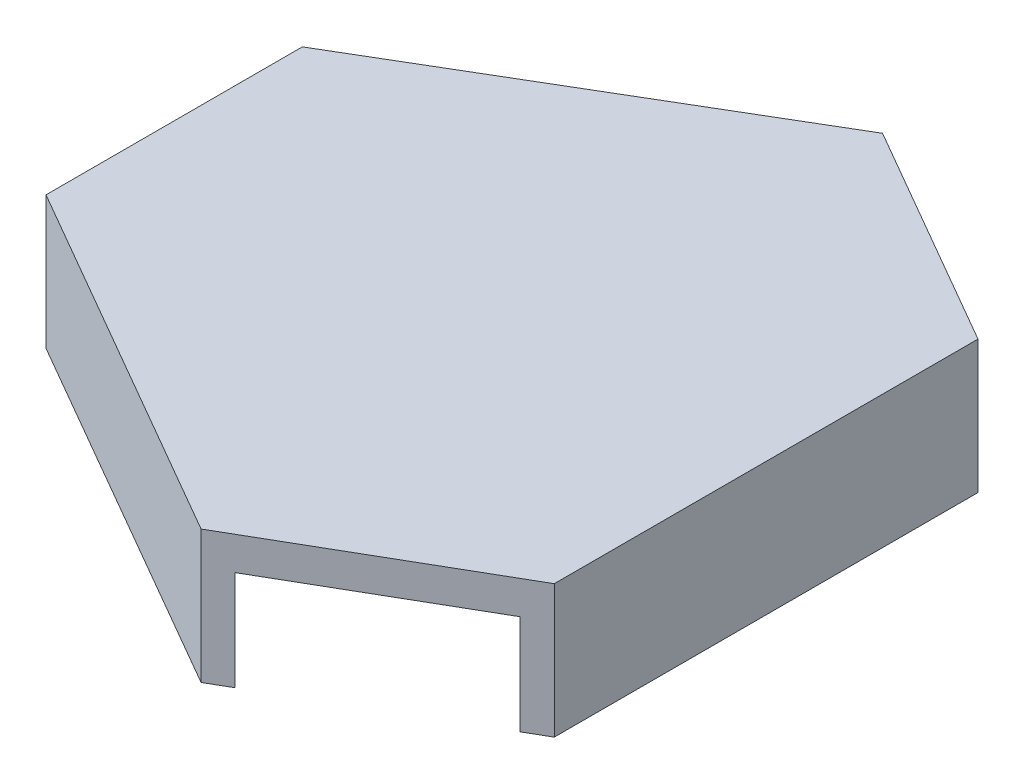
ISO-10303-21;
HEADER;
FILE_DESCRIPTION(('STEP AP214'),'2;1');
FILE_NAME('part.step','',(''),(''),'','','');
FILE_SCHEMA(('AUTOMOTIVE_DESIGN { 1 0 10303 214 1 1 1 1 }'));
ENDSEC;
DATA;
#1=APPLICATION_CONTEXT('core data for automotive mechanical design processes');
#2=APPLICATION_PROTOCOL_DEFINITION('international standard','automotive_design',2000,#1);
#3=PRODUCT_CONTEXT('',#1,'mechanical');
#4=PRODUCT('Part','Part','',(#3));
#5=PRODUCT_RELATED_PRODUCT_CATEGORY('part','',(#4));
#6=PRODUCT_DEFINITION_FORMATION('','',#4);
#7=PRODUCT_DEFINITION_CONTEXT('part definition',#1,'design');
#8=PRODUCT_DEFINITION('design','',#6,#7);
#9=PRODUCT_DEFINITION_SHAPE('','',#8);
#10=(LENGTH_UNIT() NAMED_UNIT(*) SI_UNIT(.MILLI.,.METRE.));
#11=(NAMED_UNIT(*) PLANE_ANGLE_UNIT() SI_UNIT($,.RADIAN.));
#12=(NAMED_UNIT(*) SI_UNIT($,.STERADIAN.) SOLID_ANGLE_UNIT());
#13=UNCERTAINTY_MEASURE_WITH_UNIT(LENGTH_MEASURE(1.E-05),#10,'distance_accuracy_value','');
#14=(GEOMETRIC_REPRESENTATION_CONTEXT(3) GLOBAL_UNCERTAINTY_ASSIGNED_CONTEXT((#13)) GLOBAL_UNIT_ASSIGNED_CONTEXT((#10,
#11,#12)) REPRESENTATION_CONTEXT('',''));
#15=CARTESIAN_POINT('',(0.,0.,0.));
#16=DIRECTION('',(0.,0.,1.));
#17=DIRECTION('',(1.,0.,0.));
#18=AXIS2_PLACEMENT_3D('',#15,#16,#17);
#19=CARTESIAN_POINT('',(0.,0.,0.));
#20=DIRECTION('',(0.,-1.,0.));
#21=DIRECTION('',(0.,0.,-1.));
#22=AXIS2_PLACEMENT_3D('',#19,#20,#21);
#23=PLANE('',#22);
#24=DIRECTION('',(-0.865982000114035,0.,-0.500075169827992));
#25=VECTOR('',#24,1.);
#26=CARTESIAN_POINT('',(1.84177889865107,0.,-10.3000063857236));
#27=LINE('',#26,#25);
#28=CARTESIAN_POINT('',(7.99206405038261,0.,-6.74842576241073));
#29=VERTEX_POINT('',#28);
#30=CARTESIAN_POINT('',(2.48777328000961,0.,-9.92696658821826));
#31=VERTEX_POINT('',#30);
#32=EDGE_CURVE('E190',#29,#31,#27,.T.);
#33=ORIENTED_EDGE('',*,*,#32,.F.);
#34=DIRECTION('',(8.68008158397888E-05,0.,-0.999999996232809));
#35=VECTOR('',#34,1.);
#36=CARTESIAN_POINT('',(7.99206405038261,0.,-6.74842576241073));
#37=LINE('',#36,#35);
#38=CARTESIAN_POINT('',(7.99089223936877,0.,6.75157418673219));
#39=VERTEX_POINT('',#38);
#40=EDGE_CURVE('E140',#39,#29,#37,.T.);
#41=ORIENTED_EDGE('',*,*,#40,.F.);
#42=DIRECTION('',(0.866082849184076,0.,-0.499900488446644));
#43=VECTOR('',#42,1.);
#44=CARTESIAN_POINT('',(8.6404649154148,0.,6.37664273722604));
#45=LINE('',#44,#43);
#46=CARTESIAN_POINT('',(2.55121736664581,0.,9.89133861969257));
#47=VERTEX_POINT('',#46);
#48=EDGE_CURVE('E145',#47,#39,#45,.T.);
#49=ORIENTED_EDGE('',*,*,#48,.F.);
#50=DIRECTION('',(0.866025403784439,0.,0.5));
#51=VECTOR('',#50,1.);
#52=CARTESIAN_POINT('',(2.55121736664581,0.,9.89133861969257));
#53=LINE('',#52,#51);
#54=CARTESIAN_POINT('',(-9.14012558444411,0.,3.14133861969256));
#55=VERTEX_POINT('',#54);
#56=EDGE_CURVE('E166',#55,#47,#53,.T.);
#57=ORIENTED_EDGE('',*,*,#56,.F.);
#58=DIRECTION('',(0.,0.,1.));
#59=VECTOR('',#58,1.);
#60=CARTESIAN_POINT('',(-9.14012558444411,0.,-3.82233134569774));
#61=LINE('',#60,#59);
#62=CARTESIAN_POINT('',(-9.14012558444411,0.,-3.0682518399556));
#63=VERTEX_POINT('',#62);
#64=EDGE_CURVE('E185',#63,#55,#61,.T.);
#65=ORIENTED_EDGE('',*,*,#64,.F.);
#66=DIRECTION('',(-0.861325841811387,0.,0.508052944315753));
#67=VECTOR('',#66,1.);
#68=CARTESIAN_POINT('',(-9.14012558444411,0.,-3.0682518399556));
#69=LINE('',#68,#67);
#70=EDGE_CURVE('E146',#31,#63,#69,.T.);
#71=ORIENTED_EDGE('',*,*,#70,.F.);
#72=EDGE_LOOP('',(#33,#41,#49,#57,#65,#71));
#73=FACE_BOUND('',#72,.T.);
#74=ADVANCED_FACE('F34',(#73),#23,.T.);
#75=CARTESIAN_POINT('',(-9.14012558444411,1.,-3.82233134569774));
#76=DIRECTION('',(1.,0.,0.));
#77=DIRECTION('',(0.,0.,-1.));
#78=AXIS2_PLACEMENT_3D('',#75,#76,#77);
#79=PLANE('',#78);
#80=DIRECTION('',(0.,-1.,0.));
#81=VECTOR('',#80,1.);
#82=CARTESIAN_POINT('',(-9.14012558444411,1.,-3.82233134569774));
#83=LINE('',#82,#81);
#84=CARTESIAN_POINT('',(-9.14012558444411,1.,-3.82233134569774));
#85=VERTEX_POINT('',#84);
#86=CARTESIAN_POINT('',(-9.14012558444411,-3.,-3.82233134569774));
#87=VERTEX_POINT('',#86);
#88=EDGE_CURVE('E200',#85,#87,#83,.T.);
#89=ORIENTED_EDGE('',*,*,#88,.T.);
#90=DIRECTION('',(0.,0.,-1.));
#91=VECTOR('',#90,1.);
#92=CARTESIAN_POINT('',(-9.14012558444411,-3.,-3.82233134569774));
#93=LINE('',#92,#91);
#94=CARTESIAN_POINT('',(-9.14012558444411,-3.,-3.0682518399556));
#95=VERTEX_POINT('',#94);
#96=EDGE_CURVE('E159',#95,#87,#93,.T.);
#97=ORIENTED_EDGE('',*,*,#96,.F.);
#98=DIRECTION('',(0.,1.,0.));
#99=VECTOR('',#98,1.);
#100=CARTESIAN_POINT('',(-9.14012558444411,-3.,-3.0682518399556));
#101=LINE('',#100,#99);
#102=EDGE_CURVE('E57',#95,#63,#101,.T.);
#103=ORIENTED_EDGE('',*,*,#102,.T.);
#104=ORIENTED_EDGE('',*,*,#64,.T.);
#105=DIRECTION('',(0.,1.,0.));
#106=VECTOR('',#105,1.);
#107=CARTESIAN_POINT('',(-9.14012558444411,-3.,3.14133861969256));
#108=LINE('',#107,#106);
#109=CARTESIAN_POINT('',(-9.14012558444411,-3.,3.14133861969256));
#110=VERTEX_POINT('',#109);
#111=EDGE_CURVE('E182',#110,#55,#108,.T.);
#112=ORIENTED_EDGE('',*,*,#111,.F.);
#113=DIRECTION('',(0.,0.,-1.));
#114=VECTOR('',#113,1.);
#115=CARTESIAN_POINT('',(-9.14012558444411,-3.,3.14133861969256));
#116=LINE('',#115,#114);
#117=CARTESIAN_POINT('',(-9.14012558444411,-3.,3.89123911804001));
#118=VERTEX_POINT('',#117);
#119=EDGE_CURVE('E167',#118,#110,#116,.T.);
#120=ORIENTED_EDGE('',*,*,#119,.F.);
#121=DIRECTION('',(0.,-1.,0.));
#122=VECTOR('',#121,1.);
#123=CARTESIAN_POINT('',(-9.14012558444411,1.,3.89123911804001));
#124=LINE('',#123,#122);
#125=CARTESIAN_POINT('',(-9.14012558444411,1.,3.89123911804001));
#126=VERTEX_POINT('',#125);
#127=EDGE_CURVE('E11',#126,#118,#124,.T.);
#128=ORIENTED_EDGE('',*,*,#127,.F.);
#129=DIRECTION('',(0.,0.,1.));
#130=VECTOR('',#129,1.);
#131=CARTESIAN_POINT('',(-9.14012558444411,1.,-3.82233134569774));
#132=LINE('',#131,#130);
#133=EDGE_CURVE('E186',#85,#126,#132,.T.);
#134=ORIENTED_EDGE('',*,*,#133,.F.);
#135=EDGE_LOOP('',(#89,#97,#103,#104,#112,#120,#128,#134));
#136=FACE_BOUND('',#135,.T.);
#137=ADVANCED_FACE('F36',(#136),#79,.F.);
#138=CARTESIAN_POINT('',(-9.14012558444411,1.,3.89123911804001));
#139=DIRECTION('',(0.5,0.,-0.866025403784439));
#140=DIRECTION('',(-0.866025403784439,0.,-0.5));
#141=AXIS2_PLACEMENT_3D('',#138,#139,#140);
#142=PLANE('',#141);
#143=ORIENTED_EDGE('',*,*,#127,.T.);
#144=DIRECTION('',(-0.866025403784439,0.,-0.5));
#145=VECTOR('',#144,1.);
#146=CARTESIAN_POINT('',(-9.14012558444411,-3.,3.89123911804001));
#147=LINE('',#146,#145);
#148=CARTESIAN_POINT('',(1.90169831380748,-3.,10.26623911804));
#149=VERTEX_POINT('',#148);
#150=EDGE_CURVE('E175',#149,#118,#147,.T.);
#151=ORIENTED_EDGE('',*,*,#150,.F.);
#152=DIRECTION('',(0.,-1.,0.));
#153=VECTOR('',#152,1.);
#154=CARTESIAN_POINT('',(1.90169831380748,1.,10.26623911804));
#155=LINE('',#154,#153);
#156=CARTESIAN_POINT('',(1.90169831380748,1.,10.26623911804));
#157=VERTEX_POINT('',#156);
#158=EDGE_CURVE('E42',#157,#149,#155,.T.);
#159=ORIENTED_EDGE('',*,*,#158,.F.);
#160=DIRECTION('',(0.866025403784439,0.,0.5));
#161=VECTOR('',#160,1.);
#162=CARTESIAN_POINT('',(-9.14012558444411,1.,3.89123911804001));
#163=LINE('',#162,#161);
#164=EDGE_CURVE('E189',#126,#157,#163,.T.);
#165=ORIENTED_EDGE('',*,*,#164,.F.);
#166=EDGE_LOOP('',(#143,#151,#159,#165));
#167=FACE_BOUND('',#166,.T.);
#168=ADVANCED_FACE('F219',(#167),#142,.F.);
#169=CARTESIAN_POINT('',(8.6404649154148,1.,6.37664273722604));
#170=DIRECTION('',(-0.499900488446644,0.,-0.866082849184076));
#171=DIRECTION('',(-0.866082849184076,0.,0.499900488446644));
#172=AXIS2_PLACEMENT_3D('',#169,#170,#171);
#173=PLANE('',#172);
#174=ORIENTED_EDGE('',*,*,#158,.T.);
#175=DIRECTION('',(-0.866082849184076,0.,0.499900488446644));
#176=VECTOR('',#175,1.);
#177=CARTESIAN_POINT('',(1.90169831380748,-3.,10.26623911804));
#178=LINE('',#177,#176);
#179=CARTESIAN_POINT('',(2.55121736664581,-3.,9.89133861969257));
#180=VERTEX_POINT('',#179);
#181=EDGE_CURVE('E172',#180,#149,#178,.T.);
#182=ORIENTED_EDGE('',*,*,#181,.F.);
#183=DIRECTION('',(0.,1.,0.));
#184=VECTOR('',#183,1.);
#185=CARTESIAN_POINT('',(2.55121736664581,-3.,9.89133861969257));
#186=LINE('',#185,#184);
#187=EDGE_CURVE('E178',#180,#47,#186,.T.);
#188=ORIENTED_EDGE('',*,*,#187,.T.);
#189=ORIENTED_EDGE('',*,*,#48,.T.);
#190=DIRECTION('',(0.,1.,0.));
#191=VECTOR('',#190,1.);
#192=CARTESIAN_POINT('',(7.99089223936877,-3.,6.75157418673219));
#193=LINE('',#192,#191);
#194=CARTESIAN_POINT('',(7.99089223936877,-3.,6.75157418673219));
#195=VERTEX_POINT('',#194);
#196=EDGE_CURVE('E126',#195,#39,#193,.T.);
#197=ORIENTED_EDGE('',*,*,#196,.F.);
#198=DIRECTION('',(-0.866082849184076,0.,0.499900488446644));
#199=VECTOR('',#198,1.);
#200=CARTESIAN_POINT('',(7.99089223936877,-3.,6.75157418673219));
#201=LINE('',#200,#199);
#202=CARTESIAN_POINT('',(8.6404649154148,-3.,6.37664273722604));
#203=VERTEX_POINT('',#202);
#204=EDGE_CURVE('E131',#203,#195,#201,.T.);
#205=ORIENTED_EDGE('',*,*,#204,.F.);
#206=DIRECTION('',(0.,-1.,0.));
#207=VECTOR('',#206,1.);
#208=CARTESIAN_POINT('',(8.6404649154148,1.,6.37664273722604));
#209=LINE('',#208,#207);
#210=CARTESIAN_POINT('',(8.6404649154148,1.,6.37664273722604));
#211=VERTEX_POINT('',#210);
#212=EDGE_CURVE('E209',#211,#203,#209,.T.);
#213=ORIENTED_EDGE('',*,*,#212,.F.);
#214=DIRECTION('',(0.866082849184076,0.,-0.499900488446644));
#215=VECTOR('',#214,1.);
#216=CARTESIAN_POINT('',(8.6404649154148,1.,6.37664273722604));
#217=LINE('',#216,#215);
#218=EDGE_CURVE('E192',#157,#211,#217,.T.);
#219=ORIENTED_EDGE('',*,*,#218,.F.);
#220=EDGE_LOOP('',(#174,#182,#188,#189,#197,#205,#213,#219));
#221=FACE_BOUND('',#220,.T.);
#222=ADVANCED_FACE('F143',(#221),#173,.F.);
#223=CARTESIAN_POINT('',(8.6404649154148,1.,6.37664273722604));
#224=DIRECTION('',(-0.999999996232809,0.,-8.68008158398795E-05));
#225=DIRECTION('',(-8.68008158398795E-05,0.,0.999999996232809));
#226=AXIS2_PLACEMENT_3D('',#223,#224,#225);
#227=PLANE('',#226);
#228=ORIENTED_EDGE('',*,*,#212,.T.);
#229=DIRECTION('',(-8.68008158398795E-05,0.,0.999999996232809));
#230=VECTOR('',#229,1.);
#231=CARTESIAN_POINT('',(8.6404649154148,-3.,6.37664273722604));
#232=LINE('',#231,#230);
#233=CARTESIAN_POINT('',(8.64157162581676,-3.,-6.37335721474227));
#234=VERTEX_POINT('',#233);
#235=EDGE_CURVE('E137',#234,#203,#232,.T.);
#236=ORIENTED_EDGE('',*,*,#235,.F.);
#237=DIRECTION('',(0.,-1.,0.));
#238=VECTOR('',#237,1.);
#239=CARTESIAN_POINT('',(8.64157162581676,1.,-6.37335721474227));
#240=LINE('',#239,#238);
#241=CARTESIAN_POINT('',(8.64157162581676,1.,-6.37335721474227));
#242=VERTEX_POINT('',#241);
#243=EDGE_CURVE('E207',#242,#234,#240,.T.);
#244=ORIENTED_EDGE('',*,*,#243,.F.);
#245=DIRECTION('',(8.68008158398795E-05,0.,-0.999999996232809));
#246=VECTOR('',#245,1.);
#247=CARTESIAN_POINT('',(8.6404649154148,1.,6.37664273722604));
#248=LINE('',#247,#246);
#249=EDGE_CURVE('E194',#211,#242,#248,.T.);
#250=ORIENTED_EDGE('',*,*,#249,.F.);
#251=EDGE_LOOP('',(#228,#236,#244,#250));
#252=FACE_BOUND('',#251,.T.);
#253=ADVANCED_FACE('F234',(#252),#227,.F.);
#254=CARTESIAN_POINT('',(1.84177889865107,1.,-10.3000063857236));
#255=DIRECTION('',(-0.500075169827992,0.,0.865982000114035));
#256=DIRECTION('',(0.865982000114035,0.,0.500075169827992));
#257=AXIS2_PLACEMENT_3D('',#254,#255,#256);
#258=PLANE('',#257);
#259=ORIENTED_EDGE('',*,*,#243,.T.);
#260=DIRECTION('',(0.865982000114036,0.,0.500075169827992));
#261=VECTOR('',#260,1.);
#262=CARTESIAN_POINT('',(8.64157162581676,-3.,-6.37335721474227));
#263=LINE('',#262,#261);
#264=CARTESIAN_POINT('',(7.99206405038261,-3.,-6.74842576241073));
#265=VERTEX_POINT('',#264);
#266=EDGE_CURVE('E130',#265,#234,#263,.T.);
#267=ORIENTED_EDGE('',*,*,#266,.F.);
#268=DIRECTION('',(0.,1.,0.));
#269=VECTOR('',#268,1.);
#270=CARTESIAN_POINT('',(7.99206405038261,-3.,-6.74842576241073));
#271=LINE('',#270,#269);
#272=EDGE_CURVE('E49',#265,#29,#271,.T.);
#273=ORIENTED_EDGE('',*,*,#272,.T.);
#274=ORIENTED_EDGE('',*,*,#32,.T.);
#275=DIRECTION('',(0.,1.,0.));
#276=VECTOR('',#275,1.);
#277=CARTESIAN_POINT('',(2.48777328000961,-3.,-9.92696658821826));
#278=LINE('',#277,#276);
#279=CARTESIAN_POINT('',(2.48777328000961,-3.,-9.92696658821826));
#280=VERTEX_POINT('',#279);
#281=EDGE_CURVE('E163',#280,#31,#278,.T.);
#282=ORIENTED_EDGE('',*,*,#281,.F.);
#283=DIRECTION('',(0.865982000114035,0.,0.500075169827993));
#284=VECTOR('',#283,1.);
#285=CARTESIAN_POINT('',(2.48777328000961,-3.,-9.92696658821826));
#286=LINE('',#285,#284);
#287=CARTESIAN_POINT('',(1.84177889865107,-3.,-10.3000063857236));
#288=VERTEX_POINT('',#287);
#289=EDGE_CURVE('E155',#288,#280,#286,.T.);
#290=ORIENTED_EDGE('',*,*,#289,.F.);
#291=DIRECTION('',(0.,-1.,0.));
#292=VECTOR('',#291,1.);
#293=CARTESIAN_POINT('',(1.84177889865107,1.,-10.3000063857236));
#294=LINE('',#293,#292);
#295=CARTESIAN_POINT('',(1.84177889865107,1.,-10.3000063857236));
#296=VERTEX_POINT('',#295);
#297=EDGE_CURVE('E205',#296,#288,#294,.T.);
#298=ORIENTED_EDGE('',*,*,#297,.F.);
#299=DIRECTION('',(-0.865982000114035,0.,-0.500075169827992));
#300=VECTOR('',#299,1.);
#301=CARTESIAN_POINT('',(1.84177889865107,1.,-10.3000063857236));
#302=LINE('',#301,#300);
#303=EDGE_CURVE('E196',#242,#296,#302,.T.);
#304=ORIENTED_EDGE('',*,*,#303,.F.);
#305=EDGE_LOOP('',(#259,#267,#273,#274,#282,#290,#298,#304));
#306=FACE_BOUND('',#305,.T.);
#307=ADVANCED_FACE('F252',(#306),#258,.F.);
#308=CARTESIAN_POINT('',(-9.14012558444411,1.,-3.82233134569774));
#309=DIRECTION('',(0.508052944315753,0.,0.861325841811387));
#310=DIRECTION('',(0.861325841811387,0.,-0.508052944315753));
#311=AXIS2_PLACEMENT_3D('',#308,#309,#310);
#312=PLANE('',#311);
#313=ORIENTED_EDGE('',*,*,#297,.T.);
#314=DIRECTION('',(0.861325841811387,0.,-0.508052944315753));
#315=VECTOR('',#314,1.);
#316=CARTESIAN_POINT('',(1.84177889865107,-3.,-10.3000063857236));
#317=LINE('',#316,#315);
#318=EDGE_CURVE('E148',#87,#288,#317,.T.);
#319=ORIENTED_EDGE('',*,*,#318,.F.);
#320=ORIENTED_EDGE('',*,*,#88,.F.);
#321=DIRECTION('',(-0.861325841811387,0.,0.508052944315753));
#322=VECTOR('',#321,1.);
#323=CARTESIAN_POINT('',(-9.14012558444411,1.,-3.82233134569774));
#324=LINE('',#323,#322);
#325=EDGE_CURVE('E198',#296,#85,#324,.T.);
#326=ORIENTED_EDGE('',*,*,#325,.F.);
#327=EDGE_LOOP('',(#313,#319,#320,#326));
#328=FACE_BOUND('',#327,.T.);
#329=ADVANCED_FACE('F244',(#328),#312,.F.);
#330=CARTESIAN_POINT('',(0.,1.,0.));
#331=DIRECTION('',(0.,-1.,0.));
#332=DIRECTION('',(0.,0.,-1.));
#333=AXIS2_PLACEMENT_3D('',#330,#331,#332);
#334=PLANE('',#333);
#335=ORIENTED_EDGE('',*,*,#133,.T.);
#336=ORIENTED_EDGE('',*,*,#164,.T.);
#337=ORIENTED_EDGE('',*,*,#218,.T.);
#338=ORIENTED_EDGE('',*,*,#249,.T.);
#339=ORIENTED_EDGE('',*,*,#303,.T.);
#340=ORIENTED_EDGE('',*,*,#325,.T.);
#341=EDGE_LOOP('',(#335,#336,#337,#338,#339,#340));
#342=FACE_BOUND('',#341,.T.);
#343=ADVANCED_FACE('F238',(#342),#334,.F.);
#344=CARTESIAN_POINT('',(2.55121736664581,-3.,9.89133861969257));
#345=DIRECTION('',(-0.5,0.,0.866025403784439));
#346=DIRECTION('',(0.866025403784439,0.,0.5));
#347=AXIS2_PLACEMENT_3D('',#344,#345,#346);
#348=PLANE('',#347);
#349=ORIENTED_EDGE('',*,*,#56,.T.);
#350=ORIENTED_EDGE('',*,*,#187,.F.);
#351=DIRECTION('',(0.866025403784439,0.,0.5));
#352=VECTOR('',#351,1.);
#353=CARTESIAN_POINT('',(2.55121736664581,-3.,9.89133861969257));
#354=LINE('',#353,#352);
#355=EDGE_CURVE('E170',#110,#180,#354,.T.);
#356=ORIENTED_EDGE('',*,*,#355,.F.);
#357=ORIENTED_EDGE('',*,*,#111,.T.);
#358=EDGE_LOOP('',(#349,#350,#356,#357));
#359=FACE_BOUND('',#358,.T.);
#360=ADVANCED_FACE('F226',(#359),#348,.F.);
#361=CARTESIAN_POINT('',(0.,-3.,0.));
#362=DIRECTION('',(0.,1.,0.));
#363=DIRECTION('',(0.,0.,1.));
#364=AXIS2_PLACEMENT_3D('',#361,#362,#363);
#365=PLANE('',#364);
#366=ORIENTED_EDGE('',*,*,#119,.T.);
#367=ORIENTED_EDGE('',*,*,#355,.T.);
#368=ORIENTED_EDGE('',*,*,#181,.T.);
#369=ORIENTED_EDGE('',*,*,#150,.T.);
#370=EDGE_LOOP('',(#366,#367,#368,#369));
#371=FACE_BOUND('',#370,.T.);
#372=ADVANCED_FACE('F216',(#371),#365,.F.);
#373=CARTESIAN_POINT('',(-9.14012558444411,-3.,-3.0682518399556));
#374=DIRECTION('',(-0.508052944315753,0.,-0.861325841811387));
#375=DIRECTION('',(-0.861325841811387,0.,0.508052944315753));
#376=AXIS2_PLACEMENT_3D('',#373,#374,#375);
#377=PLANE('',#376);
#378=ORIENTED_EDGE('',*,*,#70,.T.);
#379=ORIENTED_EDGE('',*,*,#102,.F.);
#380=DIRECTION('',(-0.861325841811387,0.,0.508052944315753));
#381=VECTOR('',#380,1.);
#382=CARTESIAN_POINT('',(-9.14012558444411,-3.,-3.0682518399556));
#383=LINE('',#382,#381);
#384=EDGE_CURVE('E157',#280,#95,#383,.T.);
#385=ORIENTED_EDGE('',*,*,#384,.F.);
#386=ORIENTED_EDGE('',*,*,#281,.T.);
#387=EDGE_LOOP('',(#378,#379,#385,#386));
#388=FACE_BOUND('',#387,.T.);
#389=ADVANCED_FACE('F251',(#388),#377,.F.);
#390=CARTESIAN_POINT('',(0.,-3.,0.));
#391=DIRECTION('',(0.,-1.,0.));
#392=DIRECTION('',(0.,0.,-1.));
#393=AXIS2_PLACEMENT_3D('',#390,#391,#392);
#394=PLANE('',#393);
#395=ORIENTED_EDGE('',*,*,#318,.T.);
#396=ORIENTED_EDGE('',*,*,#289,.T.);
#397=ORIENTED_EDGE('',*,*,#384,.T.);
#398=ORIENTED_EDGE('',*,*,#96,.T.);
#399=EDGE_LOOP('',(#395,#396,#397,#398));
#400=FACE_BOUND('',#399,.T.);
#401=ADVANCED_FACE('F246',(#400),#394,.T.);
#402=CARTESIAN_POINT('',(7.99206405038261,-3.,-6.74842576241073));
#403=DIRECTION('',(0.999999996232809,0.,8.68008158397888E-05));
#404=DIRECTION('',(8.68008158397888E-05,0.,-0.999999996232809));
#405=AXIS2_PLACEMENT_3D('',#402,#403,#404);
#406=PLANE('',#405);
#407=ORIENTED_EDGE('',*,*,#40,.T.);
#408=ORIENTED_EDGE('',*,*,#272,.F.);
#409=DIRECTION('',(8.68008158397888E-05,0.,-0.999999996232809));
#410=VECTOR('',#409,1.);
#411=CARTESIAN_POINT('',(7.99206405038261,-3.,-6.74842576241073));
#412=LINE('',#411,#410);
#413=EDGE_CURVE('E122',#195,#265,#412,.T.);
#414=ORIENTED_EDGE('',*,*,#413,.F.);
#415=ORIENTED_EDGE('',*,*,#196,.T.);
#416=EDGE_LOOP('',(#407,#408,#414,#415));
#417=FACE_BOUND('',#416,.T.);
#418=ADVANCED_FACE('F124',(#417),#406,.F.);
#419=CARTESIAN_POINT('',(0.,-3.,0.));
#420=DIRECTION('',(0.,1.,0.));
#421=DIRECTION('',(0.,0.,1.));
#422=AXIS2_PLACEMENT_3D('',#419,#420,#421);
#423=PLANE('',#422);
#424=ORIENTED_EDGE('',*,*,#204,.T.);
#425=ORIENTED_EDGE('',*,*,#413,.T.);
#426=ORIENTED_EDGE('',*,*,#266,.T.);
#427=ORIENTED_EDGE('',*,*,#235,.T.);
#428=EDGE_LOOP('',(#424,#425,#426,#427));
#429=FACE_BOUND('',#428,.T.);
#430=ADVANCED_FACE('F135',(#429),#423,.F.);
#431=CLOSED_SHELL('',(#74,#137,#168,#222,#253,#307,#329,#343,#360,#372,#389,#401,#418,#430));
#432=MANIFOLD_SOLID_BREP('B2',#431);
#433=ADVANCED_BREP_SHAPE_REPRESENTATION('',(#18,#432),#14);
#434=SHAPE_DEFINITION_REPRESENTATION(#9,#433);
ENDSEC;
END-ISO-10303-21;
